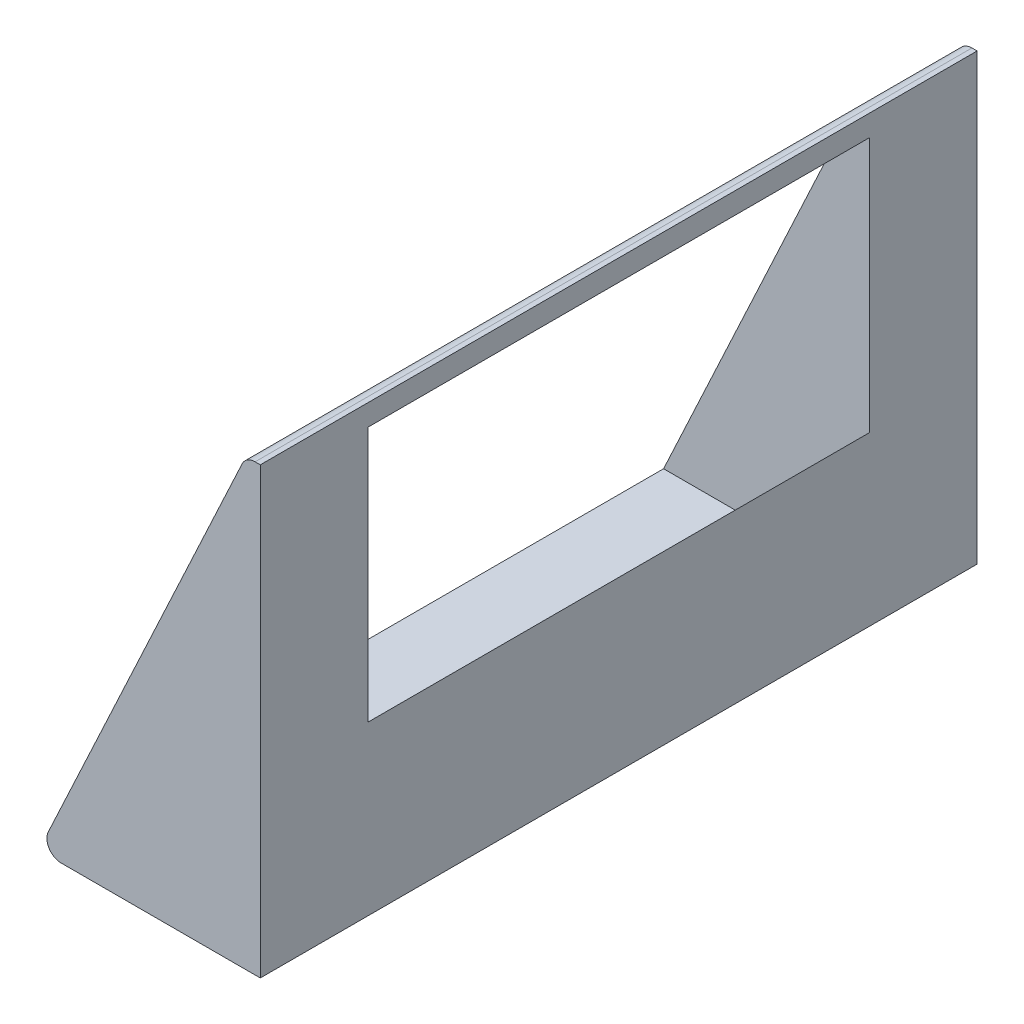
ISO-10303-21;
HEADER;
FILE_DESCRIPTION(('STEP AP214'),'2;1');
FILE_NAME('part.step','',(''),(''),'','','');
FILE_SCHEMA(('AUTOMOTIVE_DESIGN { 1 0 10303 214 1 1 1 1 }'));
ENDSEC;
DATA;
#1=APPLICATION_CONTEXT('core data for automotive mechanical design processes');
#2=APPLICATION_PROTOCOL_DEFINITION('international standard','automotive_design',2000,#1);
#3=PRODUCT_CONTEXT('',#1,'mechanical');
#4=PRODUCT('Part','Part','',(#3));
#5=PRODUCT_RELATED_PRODUCT_CATEGORY('part','',(#4));
#6=PRODUCT_DEFINITION_FORMATION('','',#4);
#7=PRODUCT_DEFINITION_CONTEXT('part definition',#1,'design');
#8=PRODUCT_DEFINITION('design','',#6,#7);
#9=PRODUCT_DEFINITION_SHAPE('','',#8);
#10=(LENGTH_UNIT() NAMED_UNIT(*) SI_UNIT(.MILLI.,.METRE.));
#11=(NAMED_UNIT(*) PLANE_ANGLE_UNIT() SI_UNIT($,.RADIAN.));
#12=(NAMED_UNIT(*) SI_UNIT($,.STERADIAN.) SOLID_ANGLE_UNIT());
#13=UNCERTAINTY_MEASURE_WITH_UNIT(LENGTH_MEASURE(1.E-05),#10,'distance_accuracy_value','');
#14=(GEOMETRIC_REPRESENTATION_CONTEXT(3) GLOBAL_UNCERTAINTY_ASSIGNED_CONTEXT((#13)) GLOBAL_UNIT_ASSIGNED_CONTEXT((#10,
#11,#12)) REPRESENTATION_CONTEXT('',''));
#15=CARTESIAN_POINT('',(0.,0.,0.));
#16=DIRECTION('',(0.,0.,1.));
#17=DIRECTION('',(1.,0.,0.));
#18=AXIS2_PLACEMENT_3D('',#15,#16,#17);
#19=CARTESIAN_POINT('',(-138.858518256876,0.,500.));
#20=DIRECTION('',(0.,1.,0.));
#21=DIRECTION('',(-1.,0.,0.));
#22=AXIS2_PLACEMENT_3D('',#19,#20,#21);
#23=PLANE('',#22);
#24=DIRECTION('',(1.,0.,0.));
#25=VECTOR('',#24,1.);
#26=CARTESIAN_POINT('',(-138.858518256876,0.,0.));
#27=LINE('',#26,#25);
#28=CARTESIAN_POINT('',(-138.858518256876,0.,0.));
#29=VERTEX_POINT('',#28);
#30=CARTESIAN_POINT('',(0.,0.,0.));
#31=VERTEX_POINT('',#30);
#32=EDGE_CURVE('E155',#29,#31,#27,.T.);
#33=ORIENTED_EDGE('',*,*,#32,.T.);
#34=DIRECTION('',(0.,0.,-1.));
#35=VECTOR('',#34,1.);
#36=CARTESIAN_POINT('',(0.,0.,500.));
#37=LINE('',#36,#35);
#38=CARTESIAN_POINT('',(0.,0.,500.));
#39=VERTEX_POINT('',#38);
#40=EDGE_CURVE('E41',#39,#31,#37,.T.);
#41=ORIENTED_EDGE('',*,*,#40,.F.);
#42=DIRECTION('',(1.,0.,0.));
#43=VECTOR('',#42,1.);
#44=CARTESIAN_POINT('',(-138.858518256876,0.,500.));
#45=LINE('',#44,#43);
#46=CARTESIAN_POINT('',(-138.858518256876,0.,500.));
#47=VERTEX_POINT('',#46);
#48=EDGE_CURVE('E156',#47,#39,#45,.T.);
#49=ORIENTED_EDGE('',*,*,#48,.F.);
#50=DIRECTION('',(0.,0.,-1.));
#51=VECTOR('',#50,1.);
#52=CARTESIAN_POINT('',(-138.858518256876,0.,500.));
#53=LINE('',#52,#51);
#54=EDGE_CURVE('E170',#47,#29,#53,.T.);
#55=ORIENTED_EDGE('',*,*,#54,.T.);
#56=EDGE_LOOP('',(#33,#41,#49,#55));
#57=FACE_BOUND('',#56,.T.);
#58=ADVANCED_FACE('F34',(#57),#23,.F.);
#59=CARTESIAN_POINT('',(0.,0.,500.));
#60=DIRECTION('',(-1.,0.,0.));
#61=DIRECTION('',(0.,0.,1.));
#62=AXIS2_PLACEMENT_3D('',#59,#60,#61);
#63=PLANE('',#62);
#64=DIRECTION('',(0.,0.,-1.));
#65=VECTOR('',#64,1.);
#66=CARTESIAN_POINT('',(0.,295.172350672904,500.));
#67=LINE('',#66,#65);
#68=CARTESIAN_POINT('',(0.,295.172350672904,425.));
#69=VERTEX_POINT('',#68);
#70=CARTESIAN_POINT('',(0.,295.172350672904,74.9999999999998));
#71=VERTEX_POINT('',#70);
#72=EDGE_CURVE('E150',#69,#71,#67,.T.);
#73=ORIENTED_EDGE('',*,*,#72,.T.);
#74=DIRECTION('',(0.,-1.,0.));
#75=VECTOR('',#74,1.);
#76=CARTESIAN_POINT('',(0.,-2.1692629894185E-13,75.));
#77=LINE('',#76,#75);
#78=CARTESIAN_POINT('',(0.,116.994377154142,74.9999999999999));
#79=VERTEX_POINT('',#78);
#80=EDGE_CURVE('E153',#71,#79,#77,.T.);
#81=ORIENTED_EDGE('',*,*,#80,.T.);
#82=DIRECTION('',(0.,0.,-1.));
#83=VECTOR('',#82,1.);
#84=CARTESIAN_POINT('',(0.,116.994377154142,500.));
#85=LINE('',#84,#83);
#86=CARTESIAN_POINT('',(0.,116.994377154142,425.));
#87=VERTEX_POINT('',#86);
#88=EDGE_CURVE('E12',#87,#79,#85,.T.);
#89=ORIENTED_EDGE('',*,*,#88,.F.);
#90=DIRECTION('',(0.,1.,0.));
#91=VECTOR('',#90,1.);
#92=CARTESIAN_POINT('',(0.,0.,425.));
#93=LINE('',#92,#91);
#94=EDGE_CURVE('E144',#87,#69,#93,.T.);
#95=ORIENTED_EDGE('',*,*,#94,.T.);
#96=EDGE_LOOP('',(#73,#81,#89,#95));
#97=FACE_BOUND('',#96,.T.);
#98=DIRECTION('',(0.,1.,0.));
#99=VECTOR('',#98,1.);
#100=CARTESIAN_POINT('',(0.,0.,0.));
#101=LINE('',#100,#99);
#102=CARTESIAN_POINT('',(0.,310.,0.));
#103=VERTEX_POINT('',#102);
#104=EDGE_CURVE('E173',#31,#103,#101,.T.);
#105=ORIENTED_EDGE('',*,*,#104,.T.);
#106=DIRECTION('',(0.,0.,-1.));
#107=VECTOR('',#106,1.);
#108=CARTESIAN_POINT('',(0.,310.,500.));
#109=LINE('',#108,#107);
#110=CARTESIAN_POINT('',(0.,310.,500.));
#111=VERTEX_POINT('',#110);
#112=EDGE_CURVE('E193',#111,#103,#109,.T.);
#113=ORIENTED_EDGE('',*,*,#112,.F.);
#114=DIRECTION('',(0.,1.,0.));
#115=VECTOR('',#114,1.);
#116=CARTESIAN_POINT('',(0.,0.,500.));
#117=LINE('',#116,#115);
#118=EDGE_CURVE('E159',#39,#111,#117,.T.);
#119=ORIENTED_EDGE('',*,*,#118,.F.);
#120=ORIENTED_EDGE('',*,*,#40,.T.);
#121=EDGE_LOOP('',(#105,#113,#119,#120));
#122=FACE_BOUND('',#121,.T.);
#123=ADVANCED_FACE('F198',(#97,#122),#63,.F.);
#124=CARTESIAN_POINT('',(0.,310.,500.));
#125=DIRECTION('',(0.,-1.,0.));
#126=DIRECTION('',(0.,0.,-1.));
#127=AXIS2_PLACEMENT_3D('',#124,#125,#126);
#128=PLANE('',#127);
#129=DIRECTION('',(-1.,0.,0.));
#130=VECTOR('',#129,1.);
#131=CARTESIAN_POINT('',(0.,310.,0.));
#132=LINE('',#131,#130);
#133=CARTESIAN_POINT('',(-3.62929739192505,310.,0.));
#134=VERTEX_POINT('',#133);
#135=EDGE_CURVE('E175',#103,#134,#132,.T.);
#136=ORIENTED_EDGE('',*,*,#135,.T.);
#137=DIRECTION('',(0.,0.,-1.));
#138=VECTOR('',#137,1.);
#139=CARTESIAN_POINT('',(-3.62929739192505,310.,500.));
#140=LINE('',#139,#138);
#141=CARTESIAN_POINT('',(-3.62929739192505,310.,500.));
#142=VERTEX_POINT('',#141);
#143=EDGE_CURVE('E190',#142,#134,#140,.T.);
#144=ORIENTED_EDGE('',*,*,#143,.F.);
#145=DIRECTION('',(-1.,0.,0.));
#146=VECTOR('',#145,1.);
#147=CARTESIAN_POINT('',(0.,310.,500.));
#148=LINE('',#147,#146);
#149=EDGE_CURVE('E162',#111,#142,#148,.T.);
#150=ORIENTED_EDGE('',*,*,#149,.F.);
#151=ORIENTED_EDGE('',*,*,#112,.T.);
#152=EDGE_LOOP('',(#136,#144,#150,#151));
#153=FACE_BOUND('',#152,.T.);
#154=ADVANCED_FACE('F212',(#153),#128,.F.);
#155=CARTESIAN_POINT('',(-3.6292973919251,300.,500.));
#156=DIRECTION('',(0.,0.,-1.));
#157=DIRECTION('',(-1.,0.,0.));
#158=AXIS2_PLACEMENT_3D('',#155,#156,#157);
#159=CYLINDRICAL_SURFACE('',#158,10.);
#160=CARTESIAN_POINT('',(-3.6292973919251,300.,0.));
#161=DIRECTION('',(0.,0.,1.));
#162=DIRECTION('',(1.,0.,0.));
#163=AXIS2_PLACEMENT_3D('',#160,#161,#162);
#164=CIRCLE('',#163,10.);
#165=CARTESIAN_POINT('',(-12.6923752622916,304.226182617407,0.));
#166=VERTEX_POINT('',#165);
#167=EDGE_CURVE('E177',#134,#166,#164,.T.);
#168=ORIENTED_EDGE('',*,*,#167,.T.);
#169=DIRECTION('',(0.,0.,-1.));
#170=VECTOR('',#169,1.);
#171=CARTESIAN_POINT('',(-12.6923752622916,304.226182617407,500.));
#172=LINE('',#171,#170);
#173=CARTESIAN_POINT('',(-12.6923752622916,304.226182617407,500.));
#174=VERTEX_POINT('',#173);
#175=EDGE_CURVE('E187',#174,#166,#172,.T.);
#176=ORIENTED_EDGE('',*,*,#175,.F.);
#177=CARTESIAN_POINT('',(-3.6292973919251,300.,500.));
#178=DIRECTION('',(0.,0.,1.));
#179=DIRECTION('',(1.,0.,0.));
#180=AXIS2_PLACEMENT_3D('',#177,#178,#179);
#181=CIRCLE('',#180,10.);
#182=EDGE_CURVE('E164',#142,#174,#181,.T.);
#183=ORIENTED_EDGE('',*,*,#182,.F.);
#184=ORIENTED_EDGE('',*,*,#143,.T.);
#185=EDGE_LOOP('',(#168,#176,#183,#184));
#186=FACE_BOUND('',#185,.T.);
#187=ADVANCED_FACE('F216',(#186),#159,.T.);
#188=CARTESIAN_POINT('',(-12.6923752622916,304.226182617407,500.));
#189=DIRECTION('',(0.906307787036648,-0.422618261740704,0.));
#190=DIRECTION('',(0.422618261740704,0.906307787036648,0.));
#191=AXIS2_PLACEMENT_3D('',#188,#189,#190);
#192=PLANE('',#191);
#193=DIRECTION('',(0.,0.,1.));
#194=VECTOR('',#193,1.);
#195=CARTESIAN_POINT('',(-143.699724955873,23.2800145619099,75.));
#196=LINE('',#195,#194);
#197=CARTESIAN_POINT('',(-143.699724955873,23.2800145619099,75.));
#198=VERTEX_POINT('',#197);
#199=CARTESIAN_POINT('',(-143.699724955873,23.28001456191,425.));
#200=VERTEX_POINT('',#199);
#201=EDGE_CURVE('E135',#198,#200,#196,.T.);
#202=ORIENTED_EDGE('',*,*,#201,.F.);
#203=DIRECTION('',(-0.422618261740704,-0.906307787036648,0.));
#204=VECTOR('',#203,1.);
#205=CARTESIAN_POINT('',(-16.9142464336616,295.172350672904,74.9999999999998));
#206=LINE('',#205,#204);
#207=CARTESIAN_POINT('',(-16.9142464336616,295.172350672904,74.9999999999998));
#208=VERTEX_POINT('',#207);
#209=EDGE_CURVE('E55',#208,#198,#206,.T.);
#210=ORIENTED_EDGE('',*,*,#209,.F.);
#211=DIRECTION('',(0.,0.,-1.));
#212=VECTOR('',#211,1.);
#213=CARTESIAN_POINT('',(-16.9142464336616,295.172350672904,74.9999999999998));
#214=LINE('',#213,#212);
#215=CARTESIAN_POINT('',(-16.9142464336616,295.172350672904,425.));
#216=VERTEX_POINT('',#215);
#217=EDGE_CURVE('E121',#216,#208,#214,.T.);
#218=ORIENTED_EDGE('',*,*,#217,.F.);
#219=DIRECTION('',(0.422618261740704,0.906307787036648,0.));
#220=VECTOR('',#219,1.);
#221=CARTESIAN_POINT('',(-16.9142464336616,295.172350672904,425.));
#222=LINE('',#221,#220);
#223=EDGE_CURVE('E137',#200,#216,#222,.T.);
#224=ORIENTED_EDGE('',*,*,#223,.F.);
#225=EDGE_LOOP('',(#202,#210,#218,#224));
#226=FACE_BOUND('',#225,.T.);
#227=DIRECTION('',(-0.422618261740704,-0.906307787036648,0.));
#228=VECTOR('',#227,1.);
#229=CARTESIAN_POINT('',(-12.6923752622916,304.226182617407,0.));
#230=LINE('',#229,#228);
#231=CARTESIAN_POINT('',(-147.921596127243,14.2261826174071,0.));
#232=VERTEX_POINT('',#231);
#233=EDGE_CURVE('E179',#166,#232,#230,.T.);
#234=ORIENTED_EDGE('',*,*,#233,.T.);
#235=DIRECTION('',(0.,0.,-1.));
#236=VECTOR('',#235,1.);
#237=CARTESIAN_POINT('',(-147.921596127243,14.2261826174071,500.));
#238=LINE('',#237,#236);
#239=CARTESIAN_POINT('',(-147.921596127243,14.2261826174071,500.));
#240=VERTEX_POINT('',#239);
#241=EDGE_CURVE('E184',#240,#232,#238,.T.);
#242=ORIENTED_EDGE('',*,*,#241,.F.);
#243=DIRECTION('',(-0.422618261740704,-0.906307787036648,0.));
#244=VECTOR('',#243,1.);
#245=CARTESIAN_POINT('',(-12.6923752622916,304.226182617407,500.));
#246=LINE('',#245,#244);
#247=EDGE_CURVE('E166',#174,#240,#246,.T.);
#248=ORIENTED_EDGE('',*,*,#247,.F.);
#249=ORIENTED_EDGE('',*,*,#175,.T.);
#250=EDGE_LOOP('',(#234,#242,#248,#249));
#251=FACE_BOUND('',#250,.T.);
#252=ADVANCED_FACE('F226',(#226,#251),#192,.F.);
#253=CARTESIAN_POINT('',(-138.858518256876,10.,500.));
#254=DIRECTION('',(0.,0.,-1.));
#255=DIRECTION('',(-1.,0.,0.));
#256=AXIS2_PLACEMENT_3D('',#253,#254,#255);
#257=CYLINDRICAL_SURFACE('',#256,10.);
#258=CARTESIAN_POINT('',(-138.858518256876,10.,0.));
#259=DIRECTION('',(0.,0.,1.));
#260=DIRECTION('',(1.,0.,0.));
#261=AXIS2_PLACEMENT_3D('',#258,#259,#260);
#262=CIRCLE('',#261,10.);
#263=EDGE_CURVE('E160',#232,#29,#262,.T.);
#264=ORIENTED_EDGE('',*,*,#263,.T.);
#265=ORIENTED_EDGE('',*,*,#54,.F.);
#266=CARTESIAN_POINT('',(-138.858518256876,10.,500.));
#267=DIRECTION('',(0.,0.,1.));
#268=DIRECTION('',(1.,0.,0.));
#269=AXIS2_PLACEMENT_3D('',#266,#267,#268);
#270=CIRCLE('',#269,10.);
#271=EDGE_CURVE('E168',#240,#47,#270,.T.);
#272=ORIENTED_EDGE('',*,*,#271,.F.);
#273=ORIENTED_EDGE('',*,*,#241,.T.);
#274=EDGE_LOOP('',(#264,#265,#272,#273));
#275=FACE_BOUND('',#274,.T.);
#276=ADVANCED_FACE('F224',(#275),#257,.T.);
#277=CARTESIAN_POINT('',(-3.6292973919251,300.,500.));
#278=DIRECTION('',(0.,0.,1.));
#279=DIRECTION('',(1.,0.,0.));
#280=AXIS2_PLACEMENT_3D('',#277,#278,#279);
#281=PLANE('',#280);
#282=ORIENTED_EDGE('',*,*,#48,.T.);
#283=ORIENTED_EDGE('',*,*,#118,.T.);
#284=ORIENTED_EDGE('',*,*,#149,.T.);
#285=ORIENTED_EDGE('',*,*,#182,.T.);
#286=ORIENTED_EDGE('',*,*,#247,.T.);
#287=ORIENTED_EDGE('',*,*,#271,.T.);
#288=EDGE_LOOP('',(#282,#283,#284,#285,#286,#287));
#289=FACE_BOUND('',#288,.T.);
#290=ADVANCED_FACE('F220',(#289),#281,.T.);
#291=CARTESIAN_POINT('',(-3.6292973919251,300.,0.));
#292=DIRECTION('',(0.,0.,1.));
#293=DIRECTION('',(1.,0.,0.));
#294=AXIS2_PLACEMENT_3D('',#291,#292,#293);
#295=PLANE('',#294);
#296=ORIENTED_EDGE('',*,*,#32,.F.);
#297=ORIENTED_EDGE('',*,*,#263,.F.);
#298=ORIENTED_EDGE('',*,*,#233,.F.);
#299=ORIENTED_EDGE('',*,*,#167,.F.);
#300=ORIENTED_EDGE('',*,*,#135,.F.);
#301=ORIENTED_EDGE('',*,*,#104,.F.);
#302=EDGE_LOOP('',(#296,#297,#298,#299,#300,#301));
#303=FACE_BOUND('',#302,.T.);
#304=ADVANCED_FACE('F206',(#303),#295,.F.);
#305=CARTESIAN_POINT('',(-26.9508267318752,59.1981427141825,0.));
#306=DIRECTION('',(-0.906307787036648,0.422618261740704,0.));
#307=DIRECTION('',(-0.422618261740704,-0.906307787036648,0.));
#308=AXIS2_PLACEMENT_3D('',#305,#306,#307);
#309=PLANE('',#308);
#310=ORIENTED_EDGE('',*,*,#88,.T.);
#311=DIRECTION('',(-0.422618261740704,-0.906307787036648,0.));
#312=VECTOR('',#311,1.);
#313=CARTESIAN_POINT('',(83.0857535663384,295.172350672904,74.9999999999998));
#314=LINE('',#313,#312);
#315=CARTESIAN_POINT('',(-43.6997249558728,23.2800145619099,75.));
#316=VERTEX_POINT('',#315);
#317=EDGE_CURVE('E115',#79,#316,#314,.T.);
#318=ORIENTED_EDGE('',*,*,#317,.T.);
#319=DIRECTION('',(0.,0.,1.));
#320=VECTOR('',#319,1.);
#321=CARTESIAN_POINT('',(-43.6997249558728,23.2800145619099,75.));
#322=LINE('',#321,#320);
#323=CARTESIAN_POINT('',(-43.6997249558727,23.28001456191,425.));
#324=VERTEX_POINT('',#323);
#325=EDGE_CURVE('E118',#316,#324,#322,.T.);
#326=ORIENTED_EDGE('',*,*,#325,.T.);
#327=DIRECTION('',(0.422618261740704,0.906307787036648,0.));
#328=VECTOR('',#327,1.);
#329=CARTESIAN_POINT('',(83.0857535663384,295.172350672904,425.));
#330=LINE('',#329,#328);
#331=EDGE_CURVE('E47',#324,#87,#330,.T.);
#332=ORIENTED_EDGE('',*,*,#331,.T.);
#333=EDGE_LOOP('',(#310,#318,#326,#332));
#334=FACE_BOUND('',#333,.T.);
#335=ADVANCED_FACE('F116',(#334),#309,.T.);
#336=CARTESIAN_POINT('',(83.0857535663384,295.172350672904,74.9999999999998));
#337=DIRECTION('',(0.,0.,-1.));
#338=DIRECTION('',(0.,1.,0.));
#339=AXIS2_PLACEMENT_3D('',#336,#337,#338);
#340=PLANE('',#339);
#341=DIRECTION('',(-1.,0.,0.));
#342=VECTOR('',#341,1.);
#343=CARTESIAN_POINT('',(83.0857535663384,295.172350672904,74.9999999999998));
#344=LINE('',#343,#342);
#345=EDGE_CURVE('E142',#71,#208,#344,.T.);
#346=ORIENTED_EDGE('',*,*,#345,.T.);
#347=ORIENTED_EDGE('',*,*,#209,.T.);
#348=DIRECTION('',(-1.,0.,0.));
#349=VECTOR('',#348,1.);
#350=CARTESIAN_POINT('',(-43.6997249558728,23.2800145619099,75.));
#351=LINE('',#350,#349);
#352=EDGE_CURVE('E123',#316,#198,#351,.T.);
#353=ORIENTED_EDGE('',*,*,#352,.F.);
#354=ORIENTED_EDGE('',*,*,#317,.F.);
#355=ORIENTED_EDGE('',*,*,#80,.F.);
#356=EDGE_LOOP('',(#346,#347,#353,#354,#355));
#357=FACE_BOUND('',#356,.T.);
#358=ADVANCED_FACE('F124',(#357),#340,.F.);
#359=CARTESIAN_POINT('',(83.0857535663384,295.172350672904,74.9999999999998));
#360=DIRECTION('',(0.,1.,0.));
#361=DIRECTION('',(0.,0.,1.));
#362=AXIS2_PLACEMENT_3D('',#359,#360,#361);
#363=PLANE('',#362);
#364=DIRECTION('',(-1.,0.,0.));
#365=VECTOR('',#364,1.);
#366=CARTESIAN_POINT('',(83.0857535663384,295.172350672904,425.));
#367=LINE('',#366,#365);
#368=EDGE_CURVE('E145',#69,#216,#367,.T.);
#369=ORIENTED_EDGE('',*,*,#368,.T.);
#370=ORIENTED_EDGE('',*,*,#217,.T.);
#371=ORIENTED_EDGE('',*,*,#345,.F.);
#372=ORIENTED_EDGE('',*,*,#72,.F.);
#373=EDGE_LOOP('',(#369,#370,#371,#372));
#374=FACE_BOUND('',#373,.T.);
#375=ADVANCED_FACE('F248',(#374),#363,.F.);
#376=CARTESIAN_POINT('',(83.0857535663384,295.172350672904,425.));
#377=DIRECTION('',(0.,0.,1.));
#378=DIRECTION('',(0.,-1.,0.));
#379=AXIS2_PLACEMENT_3D('',#376,#377,#378);
#380=PLANE('',#379);
#381=ORIENTED_EDGE('',*,*,#331,.F.);
#382=DIRECTION('',(-1.,0.,0.));
#383=VECTOR('',#382,1.);
#384=CARTESIAN_POINT('',(-43.6997249558727,23.28001456191,425.));
#385=LINE('',#384,#383);
#386=EDGE_CURVE('E128',#324,#200,#385,.T.);
#387=ORIENTED_EDGE('',*,*,#386,.T.);
#388=ORIENTED_EDGE('',*,*,#223,.T.);
#389=ORIENTED_EDGE('',*,*,#368,.F.);
#390=ORIENTED_EDGE('',*,*,#94,.F.);
#391=EDGE_LOOP('',(#381,#387,#388,#389,#390));
#392=FACE_BOUND('',#391,.T.);
#393=ADVANCED_FACE('F250',(#392),#380,.F.);
#394=CARTESIAN_POINT('',(-43.6997249558728,23.2800145619099,75.));
#395=DIRECTION('',(0.,-1.,0.));
#396=DIRECTION('',(0.,0.,-1.));
#397=AXIS2_PLACEMENT_3D('',#394,#395,#396);
#398=PLANE('',#397);
#399=ORIENTED_EDGE('',*,*,#201,.T.);
#400=ORIENTED_EDGE('',*,*,#386,.F.);
#401=ORIENTED_EDGE('',*,*,#325,.F.);
#402=ORIENTED_EDGE('',*,*,#352,.T.);
#403=EDGE_LOOP('',(#399,#400,#401,#402));
#404=FACE_BOUND('',#403,.T.);
#405=ADVANCED_FACE('F130',(#404),#398,.F.);
#406=CLOSED_SHELL('',(#58,#123,#154,#187,#252,#276,#290,#304,#335,#358,#375,#393,#405));
#407=MANIFOLD_SOLID_BREP('B2',#406);
#408=ADVANCED_BREP_SHAPE_REPRESENTATION('',(#18,#407),#14);
#409=SHAPE_DEFINITION_REPRESENTATION(#9,#408);
ENDSEC;
END-ISO-10303-21;
